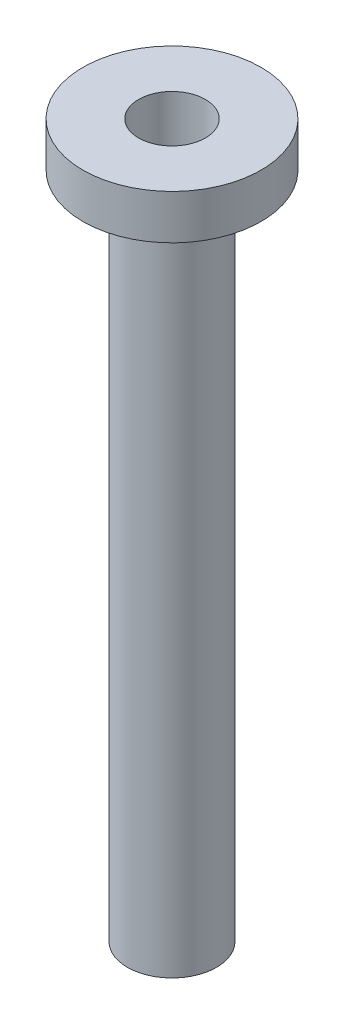
ISO-10303-21;
HEADER;
FILE_DESCRIPTION(('STEP AP214'),'2;1');
FILE_NAME('part.step','',(''),(''),'','','');
FILE_SCHEMA(('AUTOMOTIVE_DESIGN { 1 0 10303 214 1 1 1 1 }'));
ENDSEC;
DATA;
#1=APPLICATION_CONTEXT('core data for automotive mechanical design processes');
#2=APPLICATION_PROTOCOL_DEFINITION('international standard','automotive_design',2000,#1);
#3=PRODUCT_CONTEXT('',#1,'mechanical');
#4=PRODUCT('Part','Part','',(#3));
#5=PRODUCT_RELATED_PRODUCT_CATEGORY('part','',(#4));
#6=PRODUCT_DEFINITION_FORMATION('','',#4);
#7=PRODUCT_DEFINITION_CONTEXT('part definition',#1,'design');
#8=PRODUCT_DEFINITION('design','',#6,#7);
#9=PRODUCT_DEFINITION_SHAPE('','',#8);
#10=(LENGTH_UNIT() NAMED_UNIT(*) SI_UNIT(.MILLI.,.METRE.));
#11=(NAMED_UNIT(*) PLANE_ANGLE_UNIT() SI_UNIT($,.RADIAN.));
#12=(NAMED_UNIT(*) SI_UNIT($,.STERADIAN.) SOLID_ANGLE_UNIT());
#13=UNCERTAINTY_MEASURE_WITH_UNIT(LENGTH_MEASURE(1.E-05),#10,'distance_accuracy_value','');
#14=(GEOMETRIC_REPRESENTATION_CONTEXT(3) GLOBAL_UNCERTAINTY_ASSIGNED_CONTEXT((#13)) GLOBAL_UNIT_ASSIGNED_CONTEXT((#10,
#11,#12)) REPRESENTATION_CONTEXT('',''));
#15=CARTESIAN_POINT('',(0.,0.,0.));
#16=DIRECTION('',(0.,0.,1.));
#17=DIRECTION('',(1.,0.,0.));
#18=AXIS2_PLACEMENT_3D('',#15,#16,#17);
#19=CARTESIAN_POINT('',(-12.7,0.,0.));
#20=DIRECTION('',(0.,1.,0.));
#21=DIRECTION('',(0.,0.,1.));
#22=AXIS2_PLACEMENT_3D('',#19,#20,#21);
#23=PLANE('',#22);
#24=CARTESIAN_POINT('',(0.,0.,0.));
#25=DIRECTION('',(0.,1.,0.));
#26=DIRECTION('',(0.,0.,1.));
#27=AXIS2_PLACEMENT_3D('',#24,#25,#26);
#28=CIRCLE('',#27,4.76249999999999);
#29=CARTESIAN_POINT('',(0.,0.,4.76249999999999));
#30=VERTEX_POINT('',#29);
#31=EDGE_CURVE('E63',#30,#30,#28,.T.);
#32=ORIENTED_EDGE('',*,*,#31,.F.);
#33=EDGE_LOOP('',(#32));
#34=FACE_BOUND('',#33,.T.);
#35=CARTESIAN_POINT('',(0.,0.,0.));
#36=DIRECTION('',(0.,1.,0.));
#37=DIRECTION('',(0.,0.,1.));
#38=AXIS2_PLACEMENT_3D('',#35,#36,#37);
#39=CIRCLE('',#38,12.7);
#40=CARTESIAN_POINT('',(0.,0.,12.7));
#41=VERTEX_POINT('',#40);
#42=EDGE_CURVE('E62',#41,#41,#39,.T.);
#43=ORIENTED_EDGE('',*,*,#42,.T.);
#44=EDGE_LOOP('',(#43));
#45=FACE_BOUND('',#44,.T.);
#46=ADVANCED_FACE('F43',(#34,#45),#23,.T.);
#47=CARTESIAN_POINT('',(0.,-101.6,0.));
#48=DIRECTION('',(0.,-1.,0.));
#49=DIRECTION('',(0.,0.,-1.));
#50=AXIS2_PLACEMENT_3D('',#47,#48,#49);
#51=PLANE('',#50);
#52=CARTESIAN_POINT('',(0.,-101.6,0.));
#53=DIRECTION('',(0.,1.,0.));
#54=DIRECTION('',(0.,0.,1.));
#55=AXIS2_PLACEMENT_3D('',#52,#53,#54);
#56=CIRCLE('',#55,6.35);
#57=CARTESIAN_POINT('',(0.,-101.6,6.35));
#58=VERTEX_POINT('',#57);
#59=EDGE_CURVE('E11',#58,#58,#56,.T.);
#60=ORIENTED_EDGE('',*,*,#59,.F.);
#61=EDGE_LOOP('',(#60));
#62=FACE_BOUND('',#61,.T.);
#63=ADVANCED_FACE('F80',(#62),#51,.T.);
#64=CARTESIAN_POINT('',(0.,0.,0.));
#65=DIRECTION('',(0.,1.,0.));
#66=DIRECTION('',(0.,0.,1.));
#67=AXIS2_PLACEMENT_3D('',#64,#65,#66);
#68=CYLINDRICAL_SURFACE('',#67,6.35);
#69=ORIENTED_EDGE('',*,*,#59,.T.);
#70=EDGE_LOOP('',(#69));
#71=FACE_BOUND('',#70,.T.);
#72=CARTESIAN_POINT('',(0.,-6.35,0.));
#73=DIRECTION('',(0.,1.,0.));
#74=DIRECTION('',(0.,0.,1.));
#75=AXIS2_PLACEMENT_3D('',#72,#73,#74);
#76=CIRCLE('',#75,6.35);
#77=CARTESIAN_POINT('',(0.,-6.35,6.35));
#78=VERTEX_POINT('',#77);
#79=EDGE_CURVE('E49',#78,#78,#76,.T.);
#80=ORIENTED_EDGE('',*,*,#79,.F.);
#81=EDGE_LOOP('',(#80));
#82=FACE_BOUND('',#81,.T.);
#83=ADVANCED_FACE('F78',(#71,#82),#68,.T.);
#84=CARTESIAN_POINT('',(-6.35,-6.35,0.));
#85=DIRECTION('',(0.,-1.,0.));
#86=DIRECTION('',(0.,0.,-1.));
#87=AXIS2_PLACEMENT_3D('',#84,#85,#86);
#88=PLANE('',#87);
#89=ORIENTED_EDGE('',*,*,#79,.T.);
#90=EDGE_LOOP('',(#89));
#91=FACE_BOUND('',#90,.T.);
#92=CARTESIAN_POINT('',(0.,-6.35,0.));
#93=DIRECTION('',(0.,1.,0.));
#94=DIRECTION('',(0.,0.,1.));
#95=AXIS2_PLACEMENT_3D('',#92,#93,#94);
#96=CIRCLE('',#95,12.7);
#97=CARTESIAN_POINT('',(0.,-6.35,12.7));
#98=VERTEX_POINT('',#97);
#99=EDGE_CURVE('E66',#98,#98,#96,.T.);
#100=ORIENTED_EDGE('',*,*,#99,.F.);
#101=EDGE_LOOP('',(#100));
#102=FACE_BOUND('',#101,.T.);
#103=ADVANCED_FACE('F75',(#91,#102),#88,.T.);
#104=CARTESIAN_POINT('',(0.,0.,0.));
#105=DIRECTION('',(0.,1.,0.));
#106=DIRECTION('',(0.,0.,1.));
#107=AXIS2_PLACEMENT_3D('',#104,#105,#106);
#108=CYLINDRICAL_SURFACE('',#107,12.7);
#109=ORIENTED_EDGE('',*,*,#99,.T.);
#110=EDGE_LOOP('',(#109));
#111=FACE_BOUND('',#110,.T.);
#112=ORIENTED_EDGE('',*,*,#42,.F.);
#113=EDGE_LOOP('',(#112));
#114=FACE_BOUND('',#113,.T.);
#115=ADVANCED_FACE('F56',(#111,#114),#108,.T.);
#116=CARTESIAN_POINT('',(0.,-95.25,0.));
#117=DIRECTION('',(0.,1.,0.));
#118=DIRECTION('',(0.,0.,1.));
#119=AXIS2_PLACEMENT_3D('',#116,#117,#118);
#120=CONICAL_SURFACE('',#119,4.76249999999999,1.02974425867665);
#121=CARTESIAN_POINT('',(0.,-98.1115986981188,0.));
#122=VERTEX_POINT('',#121);
#123=VERTEX_LOOP('',#122);
#124=FACE_BOUND('',#123,.T.);
#125=CARTESIAN_POINT('',(0.,-95.25,0.));
#126=DIRECTION('',(0.,1.,0.));
#127=DIRECTION('',(0.,0.,1.));
#128=AXIS2_PLACEMENT_3D('',#125,#126,#127);
#129=CIRCLE('',#128,4.76249999999999);
#130=CARTESIAN_POINT('',(0.,-95.25,4.76249999999999));
#131=VERTEX_POINT('',#130);
#132=EDGE_CURVE('E60',#131,#131,#129,.T.);
#133=ORIENTED_EDGE('',*,*,#132,.T.);
#134=EDGE_LOOP('',(#133));
#135=FACE_BOUND('',#134,.T.);
#136=ADVANCED_FACE('F52',(#124,#135),#120,.F.);
#137=CARTESIAN_POINT('',(0.,0.,0.));
#138=DIRECTION('',(0.,1.,0.));
#139=DIRECTION('',(0.,0.,1.));
#140=AXIS2_PLACEMENT_3D('',#137,#138,#139);
#141=CYLINDRICAL_SURFACE('',#140,4.76249999999999);
#142=ORIENTED_EDGE('',*,*,#132,.F.);
#143=EDGE_LOOP('',(#142));
#144=FACE_BOUND('',#143,.T.);
#145=ORIENTED_EDGE('',*,*,#31,.T.);
#146=EDGE_LOOP('',(#145));
#147=FACE_BOUND('',#146,.T.);
#148=ADVANCED_FACE('F55',(#144,#147),#141,.F.);
#149=CLOSED_SHELL('',(#46,#63,#83,#103,#115,#136,#148));
#150=MANIFOLD_SOLID_BREP('B2',#149);
#151=ADVANCED_BREP_SHAPE_REPRESENTATION('',(#18,#150),#14);
#152=SHAPE_DEFINITION_REPRESENTATION(#9,#151);
ENDSEC;
END-ISO-10303-21;
